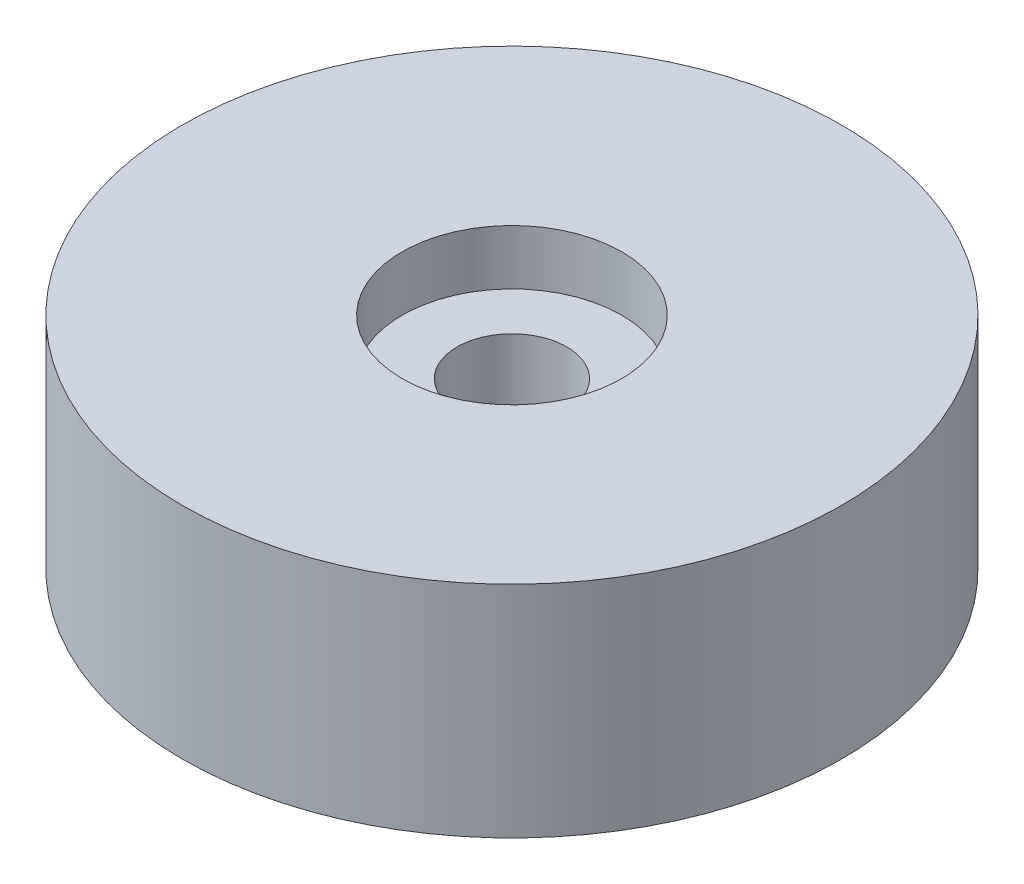
ISO-10303-21;
HEADER;
FILE_DESCRIPTION(('STEP AP214'),'2;1');
FILE_NAME('part.step','',(''),(''),'','','');
FILE_SCHEMA(('AUTOMOTIVE_DESIGN { 1 0 10303 214 1 1 1 1 }'));
ENDSEC;
DATA;
#1=APPLICATION_CONTEXT('core data for automotive mechanical design processes');
#2=APPLICATION_PROTOCOL_DEFINITION('international standard','automotive_design',2000,#1);
#3=PRODUCT_CONTEXT('',#1,'mechanical');
#4=PRODUCT('Part','Part','',(#3));
#5=PRODUCT_RELATED_PRODUCT_CATEGORY('part','',(#4));
#6=PRODUCT_DEFINITION_FORMATION('','',#4);
#7=PRODUCT_DEFINITION_CONTEXT('part definition',#1,'design');
#8=PRODUCT_DEFINITION('design','',#6,#7);
#9=PRODUCT_DEFINITION_SHAPE('','',#8);
#10=(LENGTH_UNIT() NAMED_UNIT(*) SI_UNIT(.MILLI.,.METRE.));
#11=(NAMED_UNIT(*) PLANE_ANGLE_UNIT() SI_UNIT($,.RADIAN.));
#12=(NAMED_UNIT(*) SI_UNIT($,.STERADIAN.) SOLID_ANGLE_UNIT());
#13=UNCERTAINTY_MEASURE_WITH_UNIT(LENGTH_MEASURE(1.E-05),#10,'distance_accuracy_value','');
#14=(GEOMETRIC_REPRESENTATION_CONTEXT(3) GLOBAL_UNCERTAINTY_ASSIGNED_CONTEXT((#13)) GLOBAL_UNIT_ASSIGNED_CONTEXT((#10,
#11,#12)) REPRESENTATION_CONTEXT('',''));
#15=CARTESIAN_POINT('',(0.,0.,0.));
#16=DIRECTION('',(0.,0.,1.));
#17=DIRECTION('',(1.,0.,0.));
#18=AXIS2_PLACEMENT_3D('',#15,#16,#17);
#19=CARTESIAN_POINT('',(0.,-17.78,0.));
#20=DIRECTION('',(0.,1.,0.));
#21=DIRECTION('',(0.,0.,1.));
#22=AXIS2_PLACEMENT_3D('',#19,#20,#21);
#23=CYLINDRICAL_SURFACE('',#22,3.175);
#24=CARTESIAN_POINT('',(0.,-12.7,0.));
#25=DIRECTION('',(0.,1.,0.));
#26=DIRECTION('',(0.,0.,1.));
#27=AXIS2_PLACEMENT_3D('',#24,#25,#26);
#28=CIRCLE('',#27,3.175);
#29=CARTESIAN_POINT('',(0.,-12.7,3.175));
#30=VERTEX_POINT('',#29);
#31=EDGE_CURVE('E43',#30,#30,#28,.T.);
#32=ORIENTED_EDGE('',*,*,#31,.F.);
#33=EDGE_LOOP('',(#32));
#34=FACE_BOUND('',#33,.T.);
#35=CARTESIAN_POINT('',(0.,-3.175,0.));
#36=DIRECTION('',(0.,1.,0.));
#37=DIRECTION('',(0.,0.,1.));
#38=AXIS2_PLACEMENT_3D('',#35,#36,#37);
#39=CIRCLE('',#38,3.175);
#40=CARTESIAN_POINT('',(0.,-3.175,3.175));
#41=VERTEX_POINT('',#40);
#42=EDGE_CURVE('E34',#41,#41,#39,.F.);
#43=ORIENTED_EDGE('',*,*,#42,.F.);
#44=EDGE_LOOP('',(#43));
#45=FACE_BOUND('',#44,.T.);
#46=ADVANCED_FACE('F30',(#34,#45),#23,.F.);
#47=CARTESIAN_POINT('',(0.,-12.7,0.));
#48=DIRECTION('',(0.,1.,0.));
#49=DIRECTION('',(0.,0.,1.));
#50=AXIS2_PLACEMENT_3D('',#47,#48,#49);
#51=CYLINDRICAL_SURFACE('',#50,19.05);
#52=CARTESIAN_POINT('',(0.,-12.7,0.));
#53=DIRECTION('',(0.,1.,0.));
#54=DIRECTION('',(0.,0.,1.));
#55=AXIS2_PLACEMENT_3D('',#52,#53,#54);
#56=CIRCLE('',#55,19.05);
#57=CARTESIAN_POINT('',(0.,-12.7,19.05));
#58=VERTEX_POINT('',#57);
#59=EDGE_CURVE('E10',#58,#58,#56,.T.);
#60=ORIENTED_EDGE('',*,*,#59,.T.);
#61=EDGE_LOOP('',(#60));
#62=FACE_BOUND('',#61,.T.);
#63=CARTESIAN_POINT('',(0.,0.,0.));
#64=DIRECTION('',(0.,1.,0.));
#65=DIRECTION('',(0.,0.,1.));
#66=AXIS2_PLACEMENT_3D('',#63,#64,#65);
#67=CIRCLE('',#66,19.05);
#68=CARTESIAN_POINT('',(0.,0.,19.05));
#69=VERTEX_POINT('',#68);
#70=EDGE_CURVE('E38',#69,#69,#67,.T.);
#71=ORIENTED_EDGE('',*,*,#70,.F.);
#72=EDGE_LOOP('',(#71));
#73=FACE_BOUND('',#72,.T.);
#74=ADVANCED_FACE('F32',(#62,#73),#51,.T.);
#75=CARTESIAN_POINT('',(0.,-12.7,0.));
#76=DIRECTION('',(0.,1.,0.));
#77=DIRECTION('',(0.,0.,1.));
#78=AXIS2_PLACEMENT_3D('',#75,#76,#77);
#79=PLANE('',#78);
#80=ORIENTED_EDGE('',*,*,#31,.T.);
#81=EDGE_LOOP('',(#80));
#82=FACE_BOUND('',#81,.T.);
#83=ORIENTED_EDGE('',*,*,#59,.F.);
#84=EDGE_LOOP('',(#83));
#85=FACE_BOUND('',#84,.T.);
#86=ADVANCED_FACE('F65',(#82,#85),#79,.F.);
#87=CARTESIAN_POINT('',(0.,0.,0.));
#88=DIRECTION('',(0.,1.,0.));
#89=DIRECTION('',(0.,0.,1.));
#90=AXIS2_PLACEMENT_3D('',#87,#88,#89);
#91=PLANE('',#90);
#92=CARTESIAN_POINT('',(0.,0.,0.));
#93=DIRECTION('',(0.,1.,0.));
#94=DIRECTION('',(0.,0.,1.));
#95=AXIS2_PLACEMENT_3D('',#92,#93,#94);
#96=CIRCLE('',#95,6.35);
#97=CARTESIAN_POINT('',(0.,0.,6.35));
#98=VERTEX_POINT('',#97);
#99=EDGE_CURVE('E47',#98,#98,#96,.T.);
#100=ORIENTED_EDGE('',*,*,#99,.F.);
#101=EDGE_LOOP('',(#100));
#102=FACE_BOUND('',#101,.T.);
#103=ORIENTED_EDGE('',*,*,#70,.T.);
#104=EDGE_LOOP('',(#103));
#105=FACE_BOUND('',#104,.T.);
#106=ADVANCED_FACE('F72',(#102,#105),#91,.T.);
#107=CARTESIAN_POINT('',(0.,-3.175,0.));
#108=DIRECTION('',(0.,1.,0.));
#109=DIRECTION('',(0.,0.,1.));
#110=AXIS2_PLACEMENT_3D('',#107,#108,#109);
#111=PLANE('',#110);
#112=CARTESIAN_POINT('',(0.,-3.175,0.));
#113=DIRECTION('',(0.,1.,0.));
#114=DIRECTION('',(0.,0.,1.));
#115=AXIS2_PLACEMENT_3D('',#112,#113,#114);
#116=CIRCLE('',#115,6.35);
#117=CARTESIAN_POINT('',(0.,-3.175,6.35));
#118=VERTEX_POINT('',#117);
#119=EDGE_CURVE('E50',#118,#118,#116,.T.);
#120=ORIENTED_EDGE('',*,*,#119,.T.);
#121=EDGE_LOOP('',(#120));
#122=FACE_BOUND('',#121,.T.);
#123=ORIENTED_EDGE('',*,*,#42,.T.);
#124=EDGE_LOOP('',(#123));
#125=FACE_BOUND('',#124,.T.);
#126=ADVANCED_FACE('F57',(#122,#125),#111,.T.);
#127=CARTESIAN_POINT('',(0.,-3.175,0.));
#128=DIRECTION('',(0.,1.,0.));
#129=DIRECTION('',(0.,0.,1.));
#130=AXIS2_PLACEMENT_3D('',#127,#128,#129);
#131=CYLINDRICAL_SURFACE('',#130,6.35);
#132=ORIENTED_EDGE('',*,*,#119,.F.);
#133=EDGE_LOOP('',(#132));
#134=FACE_BOUND('',#133,.T.);
#135=ORIENTED_EDGE('',*,*,#99,.T.);
#136=EDGE_LOOP('',(#135));
#137=FACE_BOUND('',#136,.T.);
#138=ADVANCED_FACE('F69',(#134,#137),#131,.F.);
#139=CLOSED_SHELL('',(#46,#74,#86,#106,#126,#138));
#140=MANIFOLD_SOLID_BREP('B2',#139);
#141=ADVANCED_BREP_SHAPE_REPRESENTATION('',(#18,#140),#14);
#142=SHAPE_DEFINITION_REPRESENTATION(#9,#141);
ENDSEC;
END-ISO-10303-21;
